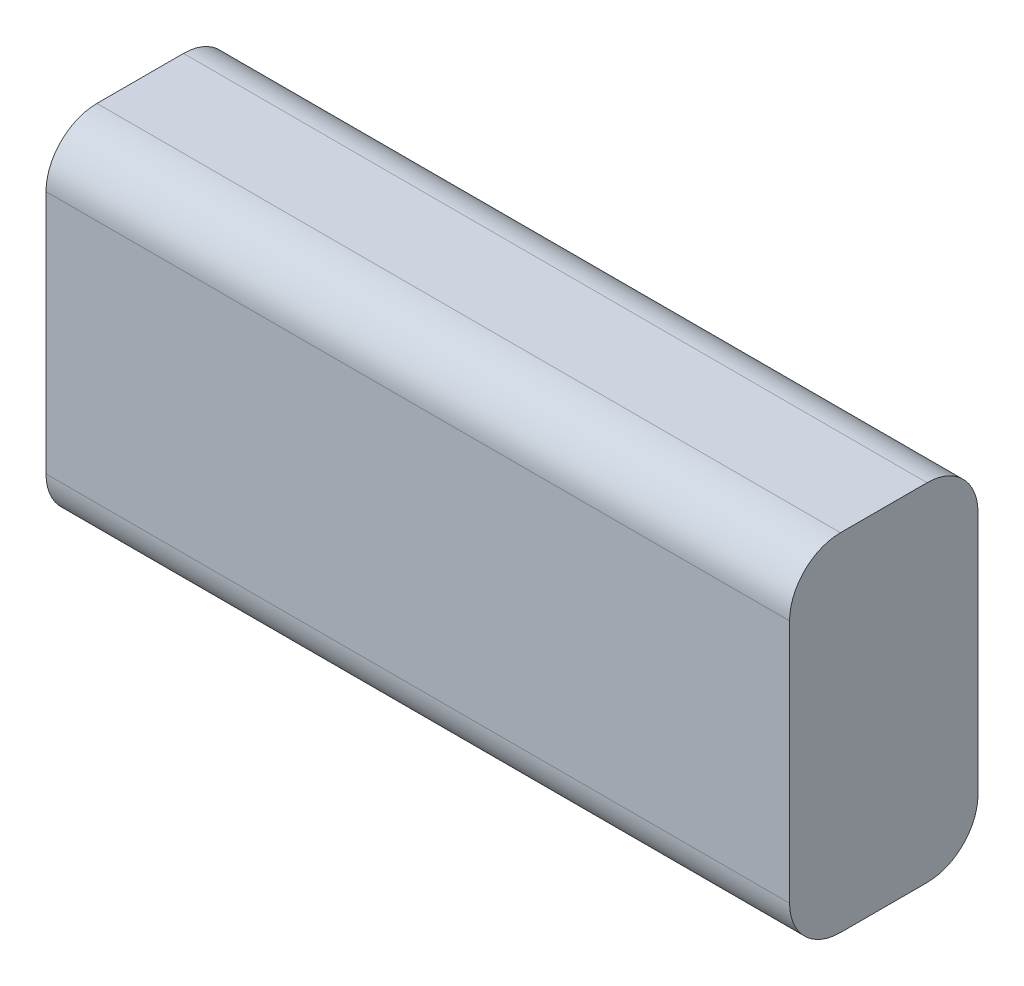
ISO-10303-21;
HEADER;
FILE_DESCRIPTION(('STEP AP214'),'2;1');
FILE_NAME('part.step','',(''),(''),'','','');
FILE_SCHEMA(('AUTOMOTIVE_DESIGN { 1 0 10303 214 1 1 1 1 }'));
ENDSEC;
DATA;
#1=APPLICATION_CONTEXT('core data for automotive mechanical design processes');
#2=APPLICATION_PROTOCOL_DEFINITION('international standard','automotive_design',2000,#1);
#3=PRODUCT_CONTEXT('',#1,'mechanical');
#4=PRODUCT('Part','Part','',(#3));
#5=PRODUCT_RELATED_PRODUCT_CATEGORY('part','',(#4));
#6=PRODUCT_DEFINITION_FORMATION('','',#4);
#7=PRODUCT_DEFINITION_CONTEXT('part definition',#1,'design');
#8=PRODUCT_DEFINITION('design','',#6,#7);
#9=PRODUCT_DEFINITION_SHAPE('','',#8);
#10=(LENGTH_UNIT() NAMED_UNIT(*) SI_UNIT(.MILLI.,.METRE.));
#11=(NAMED_UNIT(*) PLANE_ANGLE_UNIT() SI_UNIT($,.RADIAN.));
#12=(NAMED_UNIT(*) SI_UNIT($,.STERADIAN.) SOLID_ANGLE_UNIT());
#13=UNCERTAINTY_MEASURE_WITH_UNIT(LENGTH_MEASURE(1.E-05),#10,'distance_accuracy_value','');
#14=(GEOMETRIC_REPRESENTATION_CONTEXT(3) GLOBAL_UNCERTAINTY_ASSIGNED_CONTEXT((#13)) GLOBAL_UNIT_ASSIGNED_CONTEXT((#10,
#11,#12)) REPRESENTATION_CONTEXT('',''));
#15=CARTESIAN_POINT('',(0.,0.,0.));
#16=DIRECTION('',(0.,0.,1.));
#17=DIRECTION('',(1.,0.,0.));
#18=AXIS2_PLACEMENT_3D('',#15,#16,#17);
#19=CARTESIAN_POINT('',(-27.1640211640212,19.0687830687831,18.5));
#20=DIRECTION('',(1.,0.,0.));
#21=DIRECTION('',(0.,0.,-1.));
#22=AXIS2_PLACEMENT_3D('',#19,#20,#21);
#23=PLANE('',#22);
#24=DIRECTION('',(0.,-1.,0.));
#25=VECTOR('',#24,1.);
#26=CARTESIAN_POINT('',(-27.1640211640212,19.0687830687831,0.));
#27=LINE('',#26,#25);
#28=CARTESIAN_POINT('',(-27.1640211640212,14.0687830687831,0.));
#29=VERTEX_POINT('',#28);
#30=CARTESIAN_POINT('',(-27.1640211640212,-9.93121693121693,0.));
#31=VERTEX_POINT('',#30);
#32=EDGE_CURVE('E166',#29,#31,#27,.T.);
#33=ORIENTED_EDGE('',*,*,#32,.T.);
#34=CARTESIAN_POINT('',(-27.1640211640212,-9.93121693121693,5.));
#35=DIRECTION('',(1.,0.,0.));
#36=DIRECTION('',(0.,0.,-1.));
#37=AXIS2_PLACEMENT_3D('',#34,#35,#36);
#38=CIRCLE('',#37,5.);
#39=CARTESIAN_POINT('',(-27.1640211640212,-14.9312169312169,5.));
#40=VERTEX_POINT('',#39);
#41=EDGE_CURVE('E140',#31,#40,#38,.F.);
#42=ORIENTED_EDGE('',*,*,#41,.T.);
#43=DIRECTION('',(0.,0.,-1.));
#44=VECTOR('',#43,1.);
#45=CARTESIAN_POINT('',(-27.1640211640212,-14.9312169312169,18.5));
#46=LINE('',#45,#44);
#47=CARTESIAN_POINT('',(-27.1640211640212,-14.9312169312169,13.5));
#48=VERTEX_POINT('',#47);
#49=EDGE_CURVE('E119',#48,#40,#46,.T.);
#50=ORIENTED_EDGE('',*,*,#49,.F.);
#51=CARTESIAN_POINT('',(-27.1640211640212,-9.93121693121693,13.5));
#52=DIRECTION('',(1.,0.,0.));
#53=DIRECTION('',(0.,0.,-1.));
#54=AXIS2_PLACEMENT_3D('',#51,#52,#53);
#55=CIRCLE('',#54,5.);
#56=CARTESIAN_POINT('',(-27.1640211640212,-9.93121693121693,18.5));
#57=VERTEX_POINT('',#56);
#58=EDGE_CURVE('E124',#48,#57,#55,.F.);
#59=ORIENTED_EDGE('',*,*,#58,.T.);
#60=DIRECTION('',(0.,-1.,0.));
#61=VECTOR('',#60,1.);
#62=CARTESIAN_POINT('',(-27.1640211640212,19.0687830687831,18.5));
#63=LINE('',#62,#61);
#64=CARTESIAN_POINT('',(-27.1640211640212,14.0687830687831,18.5));
#65=VERTEX_POINT('',#64);
#66=EDGE_CURVE('E161',#65,#57,#63,.T.);
#67=ORIENTED_EDGE('',*,*,#66,.F.);
#68=CARTESIAN_POINT('',(-27.1640211640212,14.0687830687831,13.5));
#69=DIRECTION('',(1.,0.,0.));
#70=DIRECTION('',(0.,0.,-1.));
#71=AXIS2_PLACEMENT_3D('',#68,#69,#70);
#72=CIRCLE('',#71,5.);
#73=CARTESIAN_POINT('',(-27.1640211640212,19.0687830687831,13.5));
#74=VERTEX_POINT('',#73);
#75=EDGE_CURVE('E54',#65,#74,#72,.F.);
#76=ORIENTED_EDGE('',*,*,#75,.T.);
#77=DIRECTION('',(0.,0.,-1.));
#78=VECTOR('',#77,1.);
#79=CARTESIAN_POINT('',(-27.1640211640212,19.0687830687831,18.5));
#80=LINE('',#79,#78);
#81=CARTESIAN_POINT('',(-27.1640211640212,19.0687830687831,5.));
#82=VERTEX_POINT('',#81);
#83=EDGE_CURVE('E151',#74,#82,#80,.T.);
#84=ORIENTED_EDGE('',*,*,#83,.T.);
#85=CARTESIAN_POINT('',(-27.1640211640212,14.0687830687831,5.));
#86=DIRECTION('',(1.,0.,0.));
#87=DIRECTION('',(0.,0.,-1.));
#88=AXIS2_PLACEMENT_3D('',#85,#86,#87);
#89=CIRCLE('',#88,5.);
#90=EDGE_CURVE('E47',#82,#29,#89,.F.);
#91=ORIENTED_EDGE('',*,*,#90,.T.);
#92=EDGE_LOOP('',(#33,#42,#50,#59,#67,#76,#84,#91));
#93=FACE_BOUND('',#92,.T.);
#94=ADVANCED_FACE('F32',(#93),#23,.F.);
#95=CARTESIAN_POINT('',(-27.1640211640212,-14.9312169312169,18.5));
#96=DIRECTION('',(0.,1.,0.));
#97=DIRECTION('',(-1.,0.,0.));
#98=AXIS2_PLACEMENT_3D('',#95,#96,#97);
#99=PLANE('',#98);
#100=ORIENTED_EDGE('',*,*,#49,.T.);
#101=DIRECTION('',(1.,0.,0.));
#102=VECTOR('',#101,1.);
#103=CARTESIAN_POINT('',(-27.1640211640212,-14.9312169312169,5.));
#104=LINE('',#103,#102);
#105=CARTESIAN_POINT('',(45.8359788359788,-14.9312169312169,5.));
#106=VERTEX_POINT('',#105);
#107=EDGE_CURVE('E118',#40,#106,#104,.T.);
#108=ORIENTED_EDGE('',*,*,#107,.T.);
#109=DIRECTION('',(0.,0.,-1.));
#110=VECTOR('',#109,1.);
#111=CARTESIAN_POINT('',(45.8359788359788,-14.9312169312169,18.5));
#112=LINE('',#111,#110);
#113=CARTESIAN_POINT('',(45.8359788359788,-14.9312169312169,13.5));
#114=VERTEX_POINT('',#113);
#115=EDGE_CURVE('E101',#114,#106,#112,.T.);
#116=ORIENTED_EDGE('',*,*,#115,.F.);
#117=DIRECTION('',(1.,0.,0.));
#118=VECTOR('',#117,1.);
#119=CARTESIAN_POINT('',(-27.1640211640212,-14.9312169312169,13.5));
#120=LINE('',#119,#118);
#121=EDGE_CURVE('E115',#114,#48,#120,.F.);
#122=ORIENTED_EDGE('',*,*,#121,.T.);
#123=EDGE_LOOP('',(#100,#108,#116,#122));
#124=FACE_BOUND('',#123,.T.);
#125=ADVANCED_FACE('F114',(#124),#99,.F.);
#126=CARTESIAN_POINT('',(45.8359788359788,19.0687830687831,18.5));
#127=DIRECTION('',(-1.,0.,0.));
#128=DIRECTION('',(0.,0.,1.));
#129=AXIS2_PLACEMENT_3D('',#126,#127,#128);
#130=PLANE('',#129);
#131=ORIENTED_EDGE('',*,*,#115,.T.);
#132=CARTESIAN_POINT('',(45.8359788359788,-9.93121693121692,5.));
#133=DIRECTION('',(-1.,0.,0.));
#134=DIRECTION('',(0.,0.,1.));
#135=AXIS2_PLACEMENT_3D('',#132,#133,#134);
#136=CIRCLE('',#135,5.);
#137=CARTESIAN_POINT('',(45.8359788359788,-9.93121693121692,0.));
#138=VERTEX_POINT('',#137);
#139=EDGE_CURVE('E108',#106,#138,#136,.F.);
#140=ORIENTED_EDGE('',*,*,#139,.T.);
#141=DIRECTION('',(0.,1.,0.));
#142=VECTOR('',#141,1.);
#143=CARTESIAN_POINT('',(45.8359788359788,19.0687830687831,0.));
#144=LINE('',#143,#142);
#145=CARTESIAN_POINT('',(45.8359788359788,14.0687830687831,0.));
#146=VERTEX_POINT('',#145);
#147=EDGE_CURVE('E163',#138,#146,#144,.T.);
#148=ORIENTED_EDGE('',*,*,#147,.T.);
#149=CARTESIAN_POINT('',(45.8359788359788,14.0687830687831,5.));
#150=DIRECTION('',(-1.,0.,0.));
#151=DIRECTION('',(0.,0.,1.));
#152=AXIS2_PLACEMENT_3D('',#149,#150,#151);
#153=CIRCLE('',#152,5.);
#154=CARTESIAN_POINT('',(45.8359788359788,19.0687830687831,5.));
#155=VERTEX_POINT('',#154);
#156=EDGE_CURVE('E109',#146,#155,#153,.F.);
#157=ORIENTED_EDGE('',*,*,#156,.T.);
#158=DIRECTION('',(0.,0.,-1.));
#159=VECTOR('',#158,1.);
#160=CARTESIAN_POINT('',(45.8359788359788,19.0687830687831,18.5));
#161=LINE('',#160,#159);
#162=CARTESIAN_POINT('',(45.8359788359788,19.0687830687831,13.5));
#163=VERTEX_POINT('',#162);
#164=EDGE_CURVE('E120',#163,#155,#161,.T.);
#165=ORIENTED_EDGE('',*,*,#164,.F.);
#166=CARTESIAN_POINT('',(45.8359788359788,14.0687830687831,13.5));
#167=DIRECTION('',(-1.,0.,0.));
#168=DIRECTION('',(0.,0.,1.));
#169=AXIS2_PLACEMENT_3D('',#166,#167,#168);
#170=CIRCLE('',#169,5.);
#171=CARTESIAN_POINT('',(45.8359788359788,14.0687830687831,18.5));
#172=VERTEX_POINT('',#171);
#173=EDGE_CURVE('E126',#163,#172,#170,.F.);
#174=ORIENTED_EDGE('',*,*,#173,.T.);
#175=DIRECTION('',(0.,1.,0.));
#176=VECTOR('',#175,1.);
#177=CARTESIAN_POINT('',(45.8359788359788,19.0687830687831,18.5));
#178=LINE('',#177,#176);
#179=CARTESIAN_POINT('',(45.8359788359788,-9.93121693121692,18.5));
#180=VERTEX_POINT('',#179);
#181=EDGE_CURVE('E103',#180,#172,#178,.T.);
#182=ORIENTED_EDGE('',*,*,#181,.F.);
#183=CARTESIAN_POINT('',(45.8359788359788,-9.93121693121692,13.5));
#184=DIRECTION('',(-1.,0.,0.));
#185=DIRECTION('',(0.,0.,1.));
#186=AXIS2_PLACEMENT_3D('',#183,#184,#185);
#187=CIRCLE('',#186,5.);
#188=EDGE_CURVE('E98',#180,#114,#187,.F.);
#189=ORIENTED_EDGE('',*,*,#188,.T.);
#190=EDGE_LOOP('',(#131,#140,#148,#157,#165,#174,#182,#189));
#191=FACE_BOUND('',#190,.T.);
#192=ADVANCED_FACE('F100',(#191),#130,.F.);
#193=CARTESIAN_POINT('',(-27.1640211640212,19.0687830687831,18.5));
#194=DIRECTION('',(0.,-1.,0.));
#195=DIRECTION('',(0.,0.,-1.));
#196=AXIS2_PLACEMENT_3D('',#193,#194,#195);
#197=PLANE('',#196);
#198=ORIENTED_EDGE('',*,*,#164,.T.);
#199=DIRECTION('',(-1.,0.,0.));
#200=VECTOR('',#199,1.);
#201=CARTESIAN_POINT('',(-27.1640211640212,19.0687830687831,5.));
#202=LINE('',#201,#200);
#203=EDGE_CURVE('E11',#155,#82,#202,.T.);
#204=ORIENTED_EDGE('',*,*,#203,.T.);
#205=ORIENTED_EDGE('',*,*,#83,.F.);
#206=DIRECTION('',(-1.,0.,0.));
#207=VECTOR('',#206,1.);
#208=CARTESIAN_POINT('',(45.8359788359788,19.0687830687831,13.5));
#209=LINE('',#208,#207);
#210=EDGE_CURVE('E40',#74,#163,#209,.F.);
#211=ORIENTED_EDGE('',*,*,#210,.T.);
#212=EDGE_LOOP('',(#198,#204,#205,#211));
#213=FACE_BOUND('',#212,.T.);
#214=ADVANCED_FACE('F150',(#213),#197,.F.);
#215=CARTESIAN_POINT('',(0.,0.,18.5));
#216=DIRECTION('',(0.,0.,1.));
#217=DIRECTION('',(1.,0.,0.));
#218=AXIS2_PLACEMENT_3D('',#215,#216,#217);
#219=PLANE('',#218);
#220=ORIENTED_EDGE('',*,*,#66,.T.);
#221=DIRECTION('',(1.,0.,0.));
#222=VECTOR('',#221,1.);
#223=CARTESIAN_POINT('',(45.8359788359788,-9.93121693121692,18.5));
#224=LINE('',#223,#222);
#225=EDGE_CURVE('E145',#57,#180,#224,.T.);
#226=ORIENTED_EDGE('',*,*,#225,.T.);
#227=ORIENTED_EDGE('',*,*,#181,.T.);
#228=DIRECTION('',(-1.,0.,0.));
#229=VECTOR('',#228,1.);
#230=CARTESIAN_POINT('',(-27.1640211640212,14.0687830687831,18.5));
#231=LINE('',#230,#229);
#232=EDGE_CURVE('E142',#172,#65,#231,.T.);
#233=ORIENTED_EDGE('',*,*,#232,.T.);
#234=EDGE_LOOP('',(#220,#226,#227,#233));
#235=FACE_BOUND('',#234,.T.);
#236=ADVANCED_FACE('F160',(#235),#219,.T.);
#237=CARTESIAN_POINT('',(0.,0.,0.));
#238=DIRECTION('',(0.,0.,1.));
#239=DIRECTION('',(1.,0.,0.));
#240=AXIS2_PLACEMENT_3D('',#237,#238,#239);
#241=PLANE('',#240);
#242=ORIENTED_EDGE('',*,*,#147,.F.);
#243=DIRECTION('',(1.,0.,0.));
#244=VECTOR('',#243,1.);
#245=CARTESIAN_POINT('',(0.,-9.93121693121692,0.));
#246=LINE('',#245,#244);
#247=EDGE_CURVE('E135',#138,#31,#246,.F.);
#248=ORIENTED_EDGE('',*,*,#247,.T.);
#249=ORIENTED_EDGE('',*,*,#32,.F.);
#250=DIRECTION('',(-1.,0.,0.));
#251=VECTOR('',#250,1.);
#252=CARTESIAN_POINT('',(0.,14.0687830687831,0.));
#253=LINE('',#252,#251);
#254=EDGE_CURVE('E133',#29,#146,#253,.F.);
#255=ORIENTED_EDGE('',*,*,#254,.T.);
#256=EDGE_LOOP('',(#242,#248,#249,#255));
#257=FACE_BOUND('',#256,.T.);
#258=ADVANCED_FACE('F174',(#257),#241,.F.);
#259=CARTESIAN_POINT('',(-27.1640211640212,-9.93121693121693,5.));
#260=DIRECTION('',(1.,0.,0.));
#261=DIRECTION('',(0.,1.,0.));
#262=AXIS2_PLACEMENT_3D('',#259,#260,#261);
#263=CYLINDRICAL_SURFACE('',#262,5.);
#264=ORIENTED_EDGE('',*,*,#41,.F.);
#265=ORIENTED_EDGE('',*,*,#247,.F.);
#266=ORIENTED_EDGE('',*,*,#139,.F.);
#267=ORIENTED_EDGE('',*,*,#107,.F.);
#268=EDGE_LOOP('',(#264,#265,#266,#267));
#269=FACE_BOUND('',#268,.T.);
#270=ADVANCED_FACE('F182',(#269),#263,.T.);
#271=CARTESIAN_POINT('',(0.,-9.93121693121692,13.5));
#272=DIRECTION('',(-1.,0.,0.));
#273=DIRECTION('',(0.,-1.,0.));
#274=AXIS2_PLACEMENT_3D('',#271,#272,#273);
#275=CYLINDRICAL_SURFACE('',#274,5.);
#276=ORIENTED_EDGE('',*,*,#58,.F.);
#277=ORIENTED_EDGE('',*,*,#121,.F.);
#278=ORIENTED_EDGE('',*,*,#188,.F.);
#279=ORIENTED_EDGE('',*,*,#225,.F.);
#280=EDGE_LOOP('',(#276,#277,#278,#279));
#281=FACE_BOUND('',#280,.T.);
#282=ADVANCED_FACE('F123',(#281),#275,.T.);
#283=CARTESIAN_POINT('',(-27.1640211640212,14.0687830687831,5.));
#284=DIRECTION('',(-1.,0.,0.));
#285=DIRECTION('',(0.,0.,1.));
#286=AXIS2_PLACEMENT_3D('',#283,#284,#285);
#287=CYLINDRICAL_SURFACE('',#286,5.);
#288=ORIENTED_EDGE('',*,*,#156,.F.);
#289=ORIENTED_EDGE('',*,*,#254,.F.);
#290=ORIENTED_EDGE('',*,*,#90,.F.);
#291=ORIENTED_EDGE('',*,*,#203,.F.);
#292=EDGE_LOOP('',(#288,#289,#290,#291));
#293=FACE_BOUND('',#292,.T.);
#294=ADVANCED_FACE('F176',(#293),#287,.T.);
#295=CARTESIAN_POINT('',(0.,14.0687830687831,13.5));
#296=DIRECTION('',(1.,0.,0.));
#297=DIRECTION('',(0.,0.,-1.));
#298=AXIS2_PLACEMENT_3D('',#295,#296,#297);
#299=CYLINDRICAL_SURFACE('',#298,5.);
#300=ORIENTED_EDGE('',*,*,#173,.F.);
#301=ORIENTED_EDGE('',*,*,#210,.F.);
#302=ORIENTED_EDGE('',*,*,#75,.F.);
#303=ORIENTED_EDGE('',*,*,#232,.F.);
#304=EDGE_LOOP('',(#300,#301,#302,#303));
#305=FACE_BOUND('',#304,.T.);
#306=ADVANCED_FACE('F34',(#305),#299,.T.);
#307=CLOSED_SHELL('',(#94,#125,#192,#214,#236,#258,#270,#282,#294,#306));
#308=MANIFOLD_SOLID_BREP('B2',#307);
#309=ADVANCED_BREP_SHAPE_REPRESENTATION('',(#18,#308),#14);
#310=SHAPE_DEFINITION_REPRESENTATION(#9,#309);
ENDSEC;
END-ISO-10303-21;
